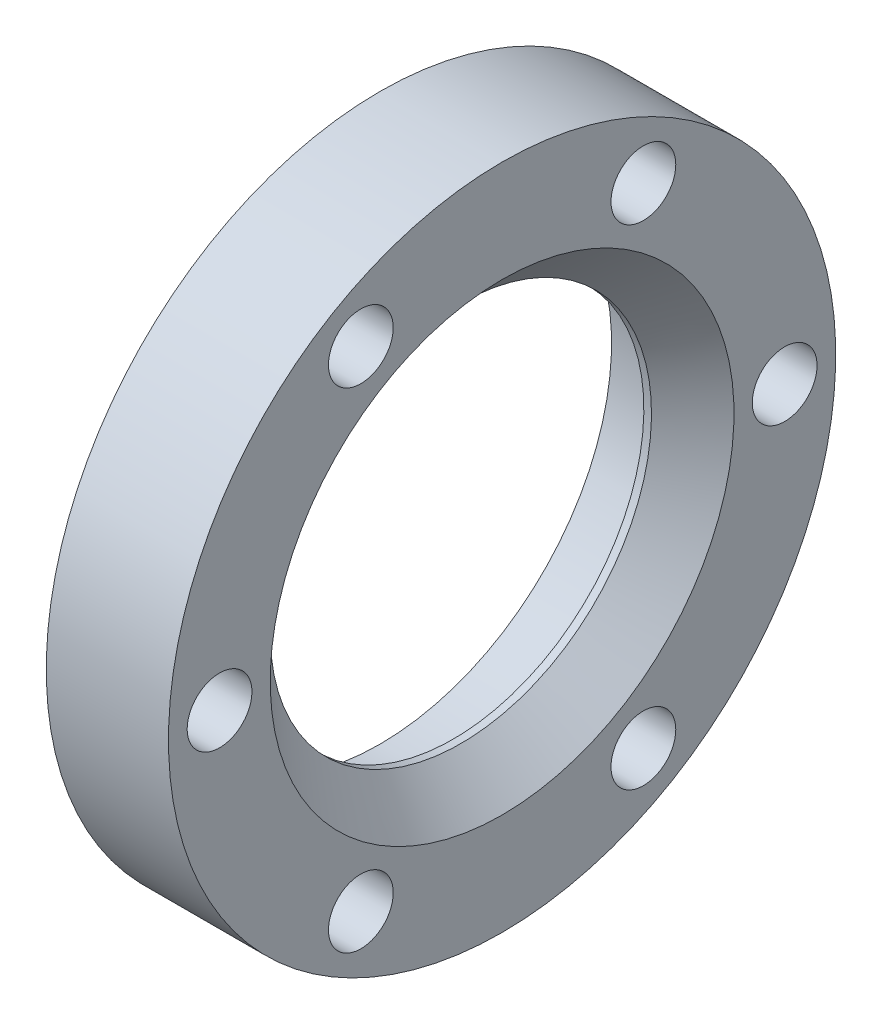
ISO-10303-21;
HEADER;
FILE_DESCRIPTION(('STEP AP214'),'2;1');
FILE_NAME('part.step','',(''),(''),'','','');
FILE_SCHEMA(('AUTOMOTIVE_DESIGN { 1 0 10303 214 1 1 1 1 }'));
ENDSEC;
DATA;
#1=APPLICATION_CONTEXT('core data for automotive mechanical design processes');
#2=APPLICATION_PROTOCOL_DEFINITION('international standard','automotive_design',2000,#1);
#3=PRODUCT_CONTEXT('',#1,'mechanical');
#4=PRODUCT('Part','Part','',(#3));
#5=PRODUCT_RELATED_PRODUCT_CATEGORY('part','',(#4));
#6=PRODUCT_DEFINITION_FORMATION('','',#4);
#7=PRODUCT_DEFINITION_CONTEXT('part definition',#1,'design');
#8=PRODUCT_DEFINITION('design','',#6,#7);
#9=PRODUCT_DEFINITION_SHAPE('','',#8);
#10=(LENGTH_UNIT() NAMED_UNIT(*) SI_UNIT(.MILLI.,.METRE.));
#11=(NAMED_UNIT(*) PLANE_ANGLE_UNIT() SI_UNIT($,.RADIAN.));
#12=(NAMED_UNIT(*) SI_UNIT($,.STERADIAN.) SOLID_ANGLE_UNIT());
#13=UNCERTAINTY_MEASURE_WITH_UNIT(LENGTH_MEASURE(1.E-05),#10,'distance_accuracy_value','');
#14=(GEOMETRIC_REPRESENTATION_CONTEXT(3) GLOBAL_UNCERTAINTY_ASSIGNED_CONTEXT((#13)) GLOBAL_UNIT_ASSIGNED_CONTEXT((#10,
#11,#12)) REPRESENTATION_CONTEXT('',''));
#15=CARTESIAN_POINT('',(0.,0.,0.));
#16=DIRECTION('',(0.,0.,1.));
#17=DIRECTION('',(1.,0.,0.));
#18=AXIS2_PLACEMENT_3D('',#15,#16,#17);
#19=CARTESIAN_POINT('',(8.01687499999896,0.,0.));
#20=DIRECTION('',(1.,0.,0.));
#21=DIRECTION('',(0.,1.,0.));
#22=AXIS2_PLACEMENT_3D('',#19,#20,#21);
#23=CYLINDRICAL_SURFACE('',#22,19.8120000000008);
#24=CARTESIAN_POINT('',(8.41374999807562,0.,0.));
#25=DIRECTION('',(1.,0.,0.));
#26=DIRECTION('',(0.,1.,0.));
#27=AXIS2_PLACEMENT_3D('',#24,#25,#26);
#28=CIRCLE('',#27,19.8120000019241);
#29=CARTESIAN_POINT('',(8.41374999807565,19.8120000019241,0.));
#30=VERTEX_POINT('',#29);
#31=EDGE_CURVE('E75',#30,#30,#28,.T.);
#32=ORIENTED_EDGE('',*,*,#31,.T.);
#33=EDGE_LOOP('',(#32));
#34=FACE_BOUND('',#33,.T.);
#35=CARTESIAN_POINT('',(7.61999999999895,0.,0.));
#36=DIRECTION('',(1.,0.,0.));
#37=DIRECTION('',(0.,1.,0.));
#38=AXIS2_PLACEMENT_3D('',#35,#36,#37);
#39=CIRCLE('',#38,19.8120000000008);
#40=CARTESIAN_POINT('',(7.61999999999898,19.8120000000008,0.));
#41=VERTEX_POINT('',#40);
#42=EDGE_CURVE('E18',#41,#41,#39,.T.);
#43=ORIENTED_EDGE('',*,*,#42,.F.);
#44=EDGE_LOOP('',(#43));
#45=FACE_BOUND('',#44,.T.);
#46=ADVANCED_FACE('F14',(#34,#45),#23,.F.);
#47=CARTESIAN_POINT('',(7.61999999999898,21.9437000000006,0.));
#48=DIRECTION('',(-1.,0.,0.));
#49=DIRECTION('',(0.,0.,1.));
#50=AXIS2_PLACEMENT_3D('',#47,#48,#49);
#51=PLANE('',#50);
#52=ORIENTED_EDGE('',*,*,#42,.T.);
#53=EDGE_LOOP('',(#52));
#54=FACE_BOUND('',#53,.T.);
#55=CARTESIAN_POINT('',(7.61999999999894,0.,0.));
#56=DIRECTION('',(1.,0.,0.));
#57=DIRECTION('',(0.,1.,0.));
#58=AXIS2_PLACEMENT_3D('',#55,#56,#57);
#59=CIRCLE('',#58,24.0754000000004);
#60=CARTESIAN_POINT('',(7.61999999999898,24.0754000000004,0.));
#61=VERTEX_POINT('',#60);
#62=EDGE_CURVE('E73',#61,#61,#59,.F.);
#63=ORIENTED_EDGE('',*,*,#62,.T.);
#64=EDGE_LOOP('',(#63));
#65=FACE_BOUND('',#64,.T.);
#66=ADVANCED_FACE('F84',(#54,#65),#51,.T.);
#67=CARTESIAN_POINT('',(12.7000000019235,0.,0.));
#68=DIRECTION('',(1.,0.,0.));
#69=DIRECTION('',(0.,1.,0.));
#70=AXIS2_PLACEMENT_3D('',#67,#68,#69);
#71=CONICAL_SURFACE('',#70,24.0982499980792,0.78539816250007);
#72=CARTESIAN_POINT('',(12.7000000019235,0.,0.));
#73=DIRECTION('',(1.,0.,0.));
#74=DIRECTION('',(0.,1.,0.));
#75=AXIS2_PLACEMENT_3D('',#72,#73,#74);
#76=CIRCLE('',#75,24.0982499980792);
#77=CARTESIAN_POINT('',(12.7000000019235,24.0982499980792,0.));
#78=VERTEX_POINT('',#77);
#79=EDGE_CURVE('E53',#78,#78,#76,.F.);
#80=ORIENTED_EDGE('',*,*,#79,.F.);
#81=EDGE_LOOP('',(#80));
#82=FACE_BOUND('',#81,.T.);
#83=ORIENTED_EDGE('',*,*,#31,.F.);
#84=EDGE_LOOP('',(#83));
#85=FACE_BOUND('',#84,.T.);
#86=ADVANCED_FACE('F94',(#82,#85),#71,.F.);
#87=CARTESIAN_POINT('',(1.240785174E-13,25.4285843160802,-14.6812));
#88=DIRECTION('',(1.,0.,0.));
#89=DIRECTION('',(0.,0.,-1.));
#90=AXIS2_PLACEMENT_3D('',#87,#88,#89);
#91=CYLINDRICAL_SURFACE('',#90,3.36549999999999);
#92=CARTESIAN_POINT('',(1.35358378E-13,25.4285843160802,-14.6812));
#93=DIRECTION('',(1.,0.,0.));
#94=DIRECTION('',(0.,0.,-1.));
#95=AXIS2_PLACEMENT_3D('',#92,#93,#94);
#96=CIRCLE('',#95,3.36549999999999);
#97=CARTESIAN_POINT('',(1.32693040020406E-13,25.4285843160802,-18.0467));
#98=VERTEX_POINT('',#97);
#99=EDGE_CURVE('E50',#98,#98,#96,.T.);
#100=ORIENTED_EDGE('',*,*,#99,.F.);
#101=EDGE_LOOP('',(#100));
#102=FACE_BOUND('',#101,.T.);
#103=CARTESIAN_POINT('',(12.7000000000002,25.4285843160802,-14.6812));
#104=DIRECTION('',(1.,0.,0.));
#105=DIRECTION('',(0.,0.,-1.));
#106=AXIS2_PLACEMENT_3D('',#103,#104,#105);
#107=CIRCLE('',#106,3.36549999999999);
#108=CARTESIAN_POINT('',(12.7000000000002,25.4285843160802,-18.0467));
#109=VERTEX_POINT('',#108);
#110=EDGE_CURVE('E71',#109,#109,#107,.F.);
#111=ORIENTED_EDGE('',*,*,#110,.F.);
#112=EDGE_LOOP('',(#111));
#113=FACE_BOUND('',#112,.T.);
#114=ADVANCED_FACE('F117',(#102,#113),#91,.F.);
#115=CARTESIAN_POINT('',(0.,0.,-29.3624));
#116=DIRECTION('',(1.,0.,0.));
#117=DIRECTION('',(0.,1.,0.));
#118=AXIS2_PLACEMENT_3D('',#115,#116,#117);
#119=CYLINDRICAL_SURFACE('',#118,3.3655);
#120=CARTESIAN_POINT('',(1.35358378E-13,0.,-29.3624));
#121=DIRECTION('',(1.,0.,0.));
#122=DIRECTION('',(0.,1.,0.));
#123=AXIS2_PLACEMENT_3D('',#120,#121,#122);
#124=CIRCLE('',#123,3.3655);
#125=CARTESIAN_POINT('',(1.414547082E-13,3.3655,-29.3624));
#126=VERTEX_POINT('',#125);
#127=EDGE_CURVE('E47',#126,#126,#124,.T.);
#128=ORIENTED_EDGE('',*,*,#127,.F.);
#129=EDGE_LOOP('',(#128));
#130=FACE_BOUND('',#129,.T.);
#131=CARTESIAN_POINT('',(12.7000000000002,0.,-29.3624));
#132=DIRECTION('',(1.,0.,0.));
#133=DIRECTION('',(0.,1.,0.));
#134=AXIS2_PLACEMENT_3D('',#131,#132,#133);
#135=CIRCLE('',#134,3.3655);
#136=CARTESIAN_POINT('',(12.7000000000002,3.36549999999998,-29.3624));
#137=VERTEX_POINT('',#136);
#138=EDGE_CURVE('E68',#137,#137,#135,.F.);
#139=ORIENTED_EDGE('',*,*,#138,.F.);
#140=EDGE_LOOP('',(#139));
#141=FACE_BOUND('',#140,.T.);
#142=ADVANCED_FACE('F123',(#130,#141),#119,.F.);
#143=CARTESIAN_POINT('',(0.,-25.4285843160802,-14.6812));
#144=DIRECTION('',(1.,0.,0.));
#145=DIRECTION('',(0.,0.,-1.));
#146=AXIS2_PLACEMENT_3D('',#143,#144,#145);
#147=CYLINDRICAL_SURFACE('',#146,3.36549999999999);
#148=CARTESIAN_POINT('',(1.35358378E-13,-25.4285843160802,-14.6812));
#149=DIRECTION('',(1.,0.,0.));
#150=DIRECTION('',(0.,0.,-1.));
#151=AXIS2_PLACEMENT_3D('',#148,#149,#150);
#152=CIRCLE('',#151,3.36549999999999);
#153=CARTESIAN_POINT('',(1.38023707180776E-13,-25.4285843160802,-18.0467));
#154=VERTEX_POINT('',#153);
#155=EDGE_CURVE('E44',#154,#154,#152,.T.);
#156=ORIENTED_EDGE('',*,*,#155,.F.);
#157=EDGE_LOOP('',(#156));
#158=FACE_BOUND('',#157,.T.);
#159=CARTESIAN_POINT('',(12.7000000000002,-25.4285843160802,-14.6812));
#160=DIRECTION('',(1.,0.,0.));
#161=DIRECTION('',(0.,0.,-1.));
#162=AXIS2_PLACEMENT_3D('',#159,#160,#161);
#163=CIRCLE('',#162,3.36549999999999);
#164=CARTESIAN_POINT('',(12.7000000000002,-25.4285843160802,-18.0467));
#165=VERTEX_POINT('',#164);
#166=EDGE_CURVE('E65',#165,#165,#163,.F.);
#167=ORIENTED_EDGE('',*,*,#166,.F.);
#168=EDGE_LOOP('',(#167));
#169=FACE_BOUND('',#168,.T.);
#170=ADVANCED_FACE('F144',(#158,#169),#147,.F.);
#171=CARTESIAN_POINT('',(0.,-25.4285843160802,14.6812));
#172=DIRECTION('',(1.,0.,0.));
#173=DIRECTION('',(0.,0.,-1.));
#174=AXIS2_PLACEMENT_3D('',#171,#172,#173);
#175=CYLINDRICAL_SURFACE('',#174,3.36549999999999);
#176=CARTESIAN_POINT('',(1.35358378E-13,-25.4285843160802,14.6812));
#177=DIRECTION('',(1.,0.,0.));
#178=DIRECTION('',(0.,0.,-1.));
#179=AXIS2_PLACEMENT_3D('',#176,#177,#178);
#180=CIRCLE('',#179,3.36549999999999);
#181=CARTESIAN_POINT('',(1.32795231693552E-13,-25.4285843160802,11.3157));
#182=VERTEX_POINT('',#181);
#183=EDGE_CURVE('E41',#182,#182,#180,.T.);
#184=ORIENTED_EDGE('',*,*,#183,.F.);
#185=EDGE_LOOP('',(#184));
#186=FACE_BOUND('',#185,.T.);
#187=CARTESIAN_POINT('',(12.7000000000002,-25.4285843160802,14.6812));
#188=DIRECTION('',(1.,0.,0.));
#189=DIRECTION('',(0.,0.,-1.));
#190=AXIS2_PLACEMENT_3D('',#187,#188,#189);
#191=CIRCLE('',#190,3.36549999999999);
#192=CARTESIAN_POINT('',(12.7000000000002,-25.4285843160802,11.3157));
#193=VERTEX_POINT('',#192);
#194=EDGE_CURVE('E62',#193,#193,#191,.F.);
#195=ORIENTED_EDGE('',*,*,#194,.F.);
#196=EDGE_LOOP('',(#195));
#197=FACE_BOUND('',#196,.T.);
#198=ADVANCED_FACE('F151',(#186,#197),#175,.F.);
#199=CARTESIAN_POINT('',(1.240785174E-13,25.4285843160802,14.6812));
#200=DIRECTION('',(1.,0.,0.));
#201=DIRECTION('',(0.,0.,-1.));
#202=AXIS2_PLACEMENT_3D('',#199,#200,#201);
#203=CYLINDRICAL_SURFACE('',#202,3.36549999999999);
#204=CARTESIAN_POINT('',(1.35358378E-13,25.4285843160802,14.6812));
#205=DIRECTION('',(1.,0.,0.));
#206=DIRECTION('',(0.,0.,-1.));
#207=AXIS2_PLACEMENT_3D('',#204,#205,#206);
#208=CIRCLE('',#207,3.36549999999999);
#209=CARTESIAN_POINT('',(1.37921517707334E-13,25.4285843160802,11.3157));
#210=VERTEX_POINT('',#209);
#211=EDGE_CURVE('E38',#210,#210,#208,.T.);
#212=ORIENTED_EDGE('',*,*,#211,.F.);
#213=EDGE_LOOP('',(#212));
#214=FACE_BOUND('',#213,.T.);
#215=CARTESIAN_POINT('',(12.7000000000002,25.4285843160802,14.6812));
#216=DIRECTION('',(1.,0.,0.));
#217=DIRECTION('',(0.,0.,-1.));
#218=AXIS2_PLACEMENT_3D('',#215,#216,#217);
#219=CIRCLE('',#218,3.36549999999999);
#220=CARTESIAN_POINT('',(12.7000000000002,25.4285843160802,11.3157));
#221=VERTEX_POINT('',#220);
#222=EDGE_CURVE('E59',#221,#221,#219,.F.);
#223=ORIENTED_EDGE('',*,*,#222,.F.);
#224=EDGE_LOOP('',(#223));
#225=FACE_BOUND('',#224,.T.);
#226=ADVANCED_FACE('F157',(#214,#225),#203,.F.);
#227=CARTESIAN_POINT('',(0.,0.,29.3624));
#228=DIRECTION('',(1.,0.,0.));
#229=DIRECTION('',(0.,1.,0.));
#230=AXIS2_PLACEMENT_3D('',#227,#228,#229);
#231=CYLINDRICAL_SURFACE('',#230,3.3655);
#232=CARTESIAN_POINT('',(1.35358378E-13,0.,29.3624));
#233=DIRECTION('',(1.,0.,0.));
#234=DIRECTION('',(0.,1.,0.));
#235=AXIS2_PLACEMENT_3D('',#232,#233,#234);
#236=CIRCLE('',#235,3.3655);
#237=CARTESIAN_POINT('',(1.413366998E-13,3.3655,29.3624));
#238=VERTEX_POINT('',#237);
#239=EDGE_CURVE('E35',#238,#238,#236,.T.);
#240=ORIENTED_EDGE('',*,*,#239,.F.);
#241=EDGE_LOOP('',(#240));
#242=FACE_BOUND('',#241,.T.);
#243=CARTESIAN_POINT('',(12.7000000000002,0.,29.3624));
#244=DIRECTION('',(1.,0.,0.));
#245=DIRECTION('',(0.,1.,0.));
#246=AXIS2_PLACEMENT_3D('',#243,#244,#245);
#247=CIRCLE('',#246,3.3655);
#248=CARTESIAN_POINT('',(12.7000000000002,3.36549999999998,29.3624));
#249=VERTEX_POINT('',#248);
#250=EDGE_CURVE('E56',#249,#249,#247,.F.);
#251=ORIENTED_EDGE('',*,*,#250,.F.);
#252=EDGE_LOOP('',(#251));
#253=FACE_BOUND('',#252,.T.);
#254=ADVANCED_FACE('F16',(#242,#253),#231,.F.);
#255=CARTESIAN_POINT('',(3.80999999999952,0.,0.));
#256=DIRECTION('',(1.,0.,0.));
#257=DIRECTION('',(0.,1.,0.));
#258=AXIS2_PLACEMENT_3D('',#255,#256,#257);
#259=CYLINDRICAL_SURFACE('',#258,24.0754000000004);
#260=ORIENTED_EDGE('',*,*,#62,.F.);
#261=EDGE_LOOP('',(#260));
#262=FACE_BOUND('',#261,.T.);
#263=CARTESIAN_POINT('',(0.,0.,0.));
#264=DIRECTION('',(1.,0.,0.));
#265=DIRECTION('',(0.,1.,0.));
#266=AXIS2_PLACEMENT_3D('',#263,#264,#265);
#267=CIRCLE('',#266,24.0754000000004);
#268=CARTESIAN_POINT('',(1.35140530413566E-13,24.0754000000004,0.));
#269=VERTEX_POINT('',#268);
#270=EDGE_CURVE('E27',#269,#269,#267,.T.);
#271=ORIENTED_EDGE('',*,*,#270,.F.);
#272=EDGE_LOOP('',(#271));
#273=FACE_BOUND('',#272,.T.);
#274=ADVANCED_FACE('F111',(#262,#273),#259,.F.);
#275=CARTESIAN_POINT('',(12.7000000000002,29.3846250000013,0.));
#276=DIRECTION('',(1.,0.,0.));
#277=DIRECTION('',(0.,0.,-1.));
#278=AXIS2_PLACEMENT_3D('',#275,#276,#277);
#279=PLANE('',#278);
#280=ORIENTED_EDGE('',*,*,#79,.T.);
#281=EDGE_LOOP('',(#280));
#282=FACE_BOUND('',#281,.T.);
#283=ORIENTED_EDGE('',*,*,#250,.T.);
#284=EDGE_LOOP('',(#283));
#285=FACE_BOUND('',#284,.T.);
#286=ORIENTED_EDGE('',*,*,#222,.T.);
#287=EDGE_LOOP('',(#286));
#288=FACE_BOUND('',#287,.T.);
#289=ORIENTED_EDGE('',*,*,#194,.T.);
#290=EDGE_LOOP('',(#289));
#291=FACE_BOUND('',#290,.T.);
#292=ORIENTED_EDGE('',*,*,#166,.T.);
#293=EDGE_LOOP('',(#292));
#294=FACE_BOUND('',#293,.T.);
#295=ORIENTED_EDGE('',*,*,#138,.T.);
#296=EDGE_LOOP('',(#295));
#297=FACE_BOUND('',#296,.T.);
#298=ORIENTED_EDGE('',*,*,#110,.T.);
#299=EDGE_LOOP('',(#298));
#300=FACE_BOUND('',#299,.T.);
#301=CARTESIAN_POINT('',(12.7000000000001,0.,0.));
#302=DIRECTION('',(1.,0.,0.));
#303=DIRECTION('',(0.,1.,0.));
#304=AXIS2_PLACEMENT_3D('',#301,#302,#303);
#305=CIRCLE('',#304,34.6710000000002);
#306=CARTESIAN_POINT('',(12.7000000000002,34.6710000000002,0.));
#307=VERTEX_POINT('',#306);
#308=EDGE_CURVE('E22',#307,#307,#305,.F.);
#309=ORIENTED_EDGE('',*,*,#308,.F.);
#310=EDGE_LOOP('',(#309));
#311=FACE_BOUND('',#310,.T.);
#312=ADVANCED_FACE('F104',(#282,#285,#288,#291,#294,#297,#300,#311),#279,.T.);
#313=CARTESIAN_POINT('',(1.35358378E-13,29.3732000000003,0.));
#314=DIRECTION('',(-1.,0.,0.));
#315=DIRECTION('',(0.,0.,1.));
#316=AXIS2_PLACEMENT_3D('',#313,#314,#315);
#317=PLANE('',#316);
#318=ORIENTED_EDGE('',*,*,#270,.T.);
#319=EDGE_LOOP('',(#318));
#320=FACE_BOUND('',#319,.T.);
#321=ORIENTED_EDGE('',*,*,#239,.T.);
#322=EDGE_LOOP('',(#321));
#323=FACE_BOUND('',#322,.T.);
#324=ORIENTED_EDGE('',*,*,#211,.T.);
#325=EDGE_LOOP('',(#324));
#326=FACE_BOUND('',#325,.T.);
#327=ORIENTED_EDGE('',*,*,#183,.T.);
#328=EDGE_LOOP('',(#327));
#329=FACE_BOUND('',#328,.T.);
#330=ORIENTED_EDGE('',*,*,#155,.T.);
#331=EDGE_LOOP('',(#330));
#332=FACE_BOUND('',#331,.T.);
#333=ORIENTED_EDGE('',*,*,#127,.T.);
#334=EDGE_LOOP('',(#333));
#335=FACE_BOUND('',#334,.T.);
#336=ORIENTED_EDGE('',*,*,#99,.T.);
#337=EDGE_LOOP('',(#336));
#338=FACE_BOUND('',#337,.T.);
#339=CARTESIAN_POINT('',(0.,0.,0.));
#340=DIRECTION('',(1.,0.,0.));
#341=DIRECTION('',(0.,1.,0.));
#342=AXIS2_PLACEMENT_3D('',#339,#340,#341);
#343=CIRCLE('',#342,34.6710000000002);
#344=CARTESIAN_POINT('',(1.35313821276015E-13,34.6710000000002,0.));
#345=VERTEX_POINT('',#344);
#346=EDGE_CURVE('E10',#345,#345,#343,.T.);
#347=ORIENTED_EDGE('',*,*,#346,.F.);
#348=EDGE_LOOP('',(#347));
#349=FACE_BOUND('',#348,.T.);
#350=ADVANCED_FACE('F98',(#320,#323,#326,#329,#332,#335,#338,#349),#317,.T.);
#351=CARTESIAN_POINT('',(6.3500000000001,0.,0.));
#352=DIRECTION('',(1.,0.,0.));
#353=DIRECTION('',(0.,1.,0.));
#354=AXIS2_PLACEMENT_3D('',#351,#352,#353);
#355=CYLINDRICAL_SURFACE('',#354,34.6710000000002);
#356=ORIENTED_EDGE('',*,*,#346,.T.);
#357=EDGE_LOOP('',(#356));
#358=FACE_BOUND('',#357,.T.);
#359=ORIENTED_EDGE('',*,*,#308,.T.);
#360=EDGE_LOOP('',(#359));
#361=FACE_BOUND('',#360,.T.);
#362=ADVANCED_FACE('F97',(#358,#361),#355,.T.);
#363=CLOSED_SHELL('',(#46,#66,#86,#114,#142,#170,#198,#226,#254,#274,#312,#350,#362));
#364=MANIFOLD_SOLID_BREP('B1',#363);
#365=ADVANCED_BREP_SHAPE_REPRESENTATION('',(#18,#364),#14);
#366=SHAPE_DEFINITION_REPRESENTATION(#9,#365);
ENDSEC;
END-ISO-10303-21;
